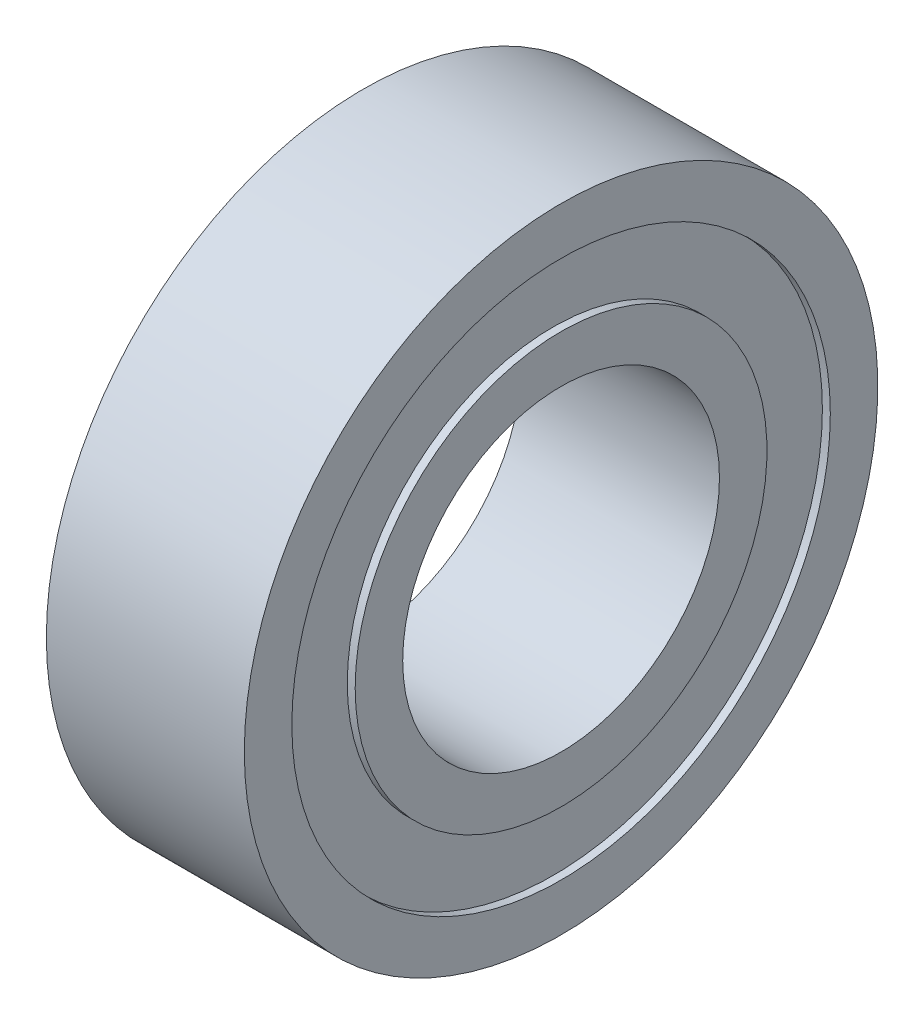
ISO-10303-21;
HEADER;
FILE_DESCRIPTION(('STEP AP214'),'2;1');
FILE_NAME('part.step','',(''),(''),'','','');
FILE_SCHEMA(('AUTOMOTIVE_DESIGN { 1 0 10303 214 1 1 1 1 }'));
ENDSEC;
DATA;
#1=APPLICATION_CONTEXT('core data for automotive mechanical design processes');
#2=APPLICATION_PROTOCOL_DEFINITION('international standard','automotive_design',2000,#1);
#3=PRODUCT_CONTEXT('',#1,'mechanical');
#4=PRODUCT('Part','Part','',(#3));
#5=PRODUCT_RELATED_PRODUCT_CATEGORY('part','',(#4));
#6=PRODUCT_DEFINITION_FORMATION('','',#4);
#7=PRODUCT_DEFINITION_CONTEXT('part definition',#1,'design');
#8=PRODUCT_DEFINITION('design','',#6,#7);
#9=PRODUCT_DEFINITION_SHAPE('','',#8);
#10=(LENGTH_UNIT() NAMED_UNIT(*) SI_UNIT(.MILLI.,.METRE.));
#11=(NAMED_UNIT(*) PLANE_ANGLE_UNIT() SI_UNIT($,.RADIAN.));
#12=(NAMED_UNIT(*) SI_UNIT($,.STERADIAN.) SOLID_ANGLE_UNIT());
#13=UNCERTAINTY_MEASURE_WITH_UNIT(LENGTH_MEASURE(1.E-05),#10,'distance_accuracy_value','');
#14=(GEOMETRIC_REPRESENTATION_CONTEXT(3) GLOBAL_UNCERTAINTY_ASSIGNED_CONTEXT((#13)) GLOBAL_UNIT_ASSIGNED_CONTEXT((#10,
#11,#12)) REPRESENTATION_CONTEXT('',''));
#15=CARTESIAN_POINT('',(0.,0.,0.));
#16=DIRECTION('',(0.,0.,1.));
#17=DIRECTION('',(1.,0.,0.));
#18=AXIS2_PLACEMENT_3D('',#15,#16,#17);
#19=CARTESIAN_POINT('',(-2.5,5.2,0.));
#20=DIRECTION('',(1.,0.,0.));
#21=DIRECTION('',(0.,0.,-1.));
#22=AXIS2_PLACEMENT_3D('',#19,#20,#21);
#23=PLANE('',#22);
#24=CARTESIAN_POINT('',(-2.5,0.,0.));
#25=DIRECTION('',(-1.,0.,0.));
#26=DIRECTION('',(0.,0.,1.));
#27=AXIS2_PLACEMENT_3D('',#24,#25,#26);
#28=CIRCLE('',#27,4.);
#29=CARTESIAN_POINT('',(-2.5,0.,4.));
#30=VERTEX_POINT('',#29);
#31=EDGE_CURVE('E10',#30,#30,#28,.T.);
#32=ORIENTED_EDGE('',*,*,#31,.F.);
#33=EDGE_LOOP('',(#32));
#34=FACE_BOUND('',#33,.T.);
#35=CARTESIAN_POINT('',(-2.5,0.,0.));
#36=DIRECTION('',(-1.,0.,0.));
#37=DIRECTION('',(0.,0.,1.));
#38=AXIS2_PLACEMENT_3D('',#35,#36,#37);
#39=CIRCLE('',#38,5.2);
#40=CARTESIAN_POINT('',(-2.5,0.,5.2));
#41=VERTEX_POINT('',#40);
#42=EDGE_CURVE('E54',#41,#41,#39,.T.);
#43=ORIENTED_EDGE('',*,*,#42,.T.);
#44=EDGE_LOOP('',(#43));
#45=FACE_BOUND('',#44,.T.);
#46=ADVANCED_FACE('F14',(#34,#45),#23,.F.);
#47=CARTESIAN_POINT('',(0.,0.,0.));
#48=DIRECTION('',(-1.,0.,0.));
#49=DIRECTION('',(0.,0.,1.));
#50=AXIS2_PLACEMENT_3D('',#47,#48,#49);
#51=CYLINDRICAL_SURFACE('',#50,4.);
#52=CARTESIAN_POINT('',(2.5,0.,0.));
#53=DIRECTION('',(-1.,0.,0.));
#54=DIRECTION('',(0.,0.,1.));
#55=AXIS2_PLACEMENT_3D('',#52,#53,#54);
#56=CIRCLE('',#55,4.);
#57=CARTESIAN_POINT('',(2.5,0.,4.));
#58=VERTEX_POINT('',#57);
#59=EDGE_CURVE('E20',#58,#58,#56,.T.);
#60=ORIENTED_EDGE('',*,*,#59,.F.);
#61=EDGE_LOOP('',(#60));
#62=FACE_BOUND('',#61,.T.);
#63=ORIENTED_EDGE('',*,*,#31,.T.);
#64=EDGE_LOOP('',(#63));
#65=FACE_BOUND('',#64,.T.);
#66=ADVANCED_FACE('F115',(#62,#65),#51,.F.);
#67=CARTESIAN_POINT('',(2.5,4.,0.));
#68=DIRECTION('',(-1.,0.,0.));
#69=DIRECTION('',(0.,0.,1.));
#70=AXIS2_PLACEMENT_3D('',#67,#68,#69);
#71=PLANE('',#70);
#72=CARTESIAN_POINT('',(2.5,0.,0.));
#73=DIRECTION('',(-1.,0.,0.));
#74=DIRECTION('',(0.,0.,1.));
#75=AXIS2_PLACEMENT_3D('',#72,#73,#74);
#76=CIRCLE('',#75,5.2);
#77=CARTESIAN_POINT('',(2.5,0.,5.2));
#78=VERTEX_POINT('',#77);
#79=EDGE_CURVE('E24',#78,#78,#76,.T.);
#80=ORIENTED_EDGE('',*,*,#79,.F.);
#81=EDGE_LOOP('',(#80));
#82=FACE_BOUND('',#81,.T.);
#83=ORIENTED_EDGE('',*,*,#59,.T.);
#84=EDGE_LOOP('',(#83));
#85=FACE_BOUND('',#84,.T.);
#86=ADVANCED_FACE('F110',(#82,#85),#71,.F.);
#87=CARTESIAN_POINT('',(0.,0.,0.));
#88=DIRECTION('',(-1.,0.,0.));
#89=DIRECTION('',(0.,0.,1.));
#90=AXIS2_PLACEMENT_3D('',#87,#88,#89);
#91=CYLINDRICAL_SURFACE('',#90,5.2);
#92=CARTESIAN_POINT('',(2.3,0.,0.));
#93=DIRECTION('',(-1.,0.,0.));
#94=DIRECTION('',(0.,0.,1.));
#95=AXIS2_PLACEMENT_3D('',#92,#93,#94);
#96=CIRCLE('',#95,5.2);
#97=CARTESIAN_POINT('',(2.3,0.,5.2));
#98=VERTEX_POINT('',#97);
#99=EDGE_CURVE('E28',#98,#98,#96,.T.);
#100=ORIENTED_EDGE('',*,*,#99,.F.);
#101=EDGE_LOOP('',(#100));
#102=FACE_BOUND('',#101,.T.);
#103=ORIENTED_EDGE('',*,*,#79,.T.);
#104=EDGE_LOOP('',(#103));
#105=FACE_BOUND('',#104,.T.);
#106=ADVANCED_FACE('F104',(#102,#105),#91,.T.);
#107=CARTESIAN_POINT('',(2.3,6.8,0.));
#108=DIRECTION('',(-1.,0.,0.));
#109=DIRECTION('',(0.,0.,1.));
#110=AXIS2_PLACEMENT_3D('',#107,#108,#109);
#111=PLANE('',#110);
#112=CARTESIAN_POINT('',(2.3,0.,0.));
#113=DIRECTION('',(-1.,0.,0.));
#114=DIRECTION('',(0.,0.,1.));
#115=AXIS2_PLACEMENT_3D('',#112,#113,#114);
#116=CIRCLE('',#115,6.8);
#117=CARTESIAN_POINT('',(2.3,0.,6.8));
#118=VERTEX_POINT('',#117);
#119=EDGE_CURVE('E33',#118,#118,#116,.T.);
#120=ORIENTED_EDGE('',*,*,#119,.F.);
#121=EDGE_LOOP('',(#120));
#122=FACE_BOUND('',#121,.T.);
#123=ORIENTED_EDGE('',*,*,#99,.T.);
#124=EDGE_LOOP('',(#123));
#125=FACE_BOUND('',#124,.T.);
#126=ADVANCED_FACE('F98',(#122,#125),#111,.F.);
#127=CARTESIAN_POINT('',(0.,0.,0.));
#128=DIRECTION('',(-1.,0.,0.));
#129=DIRECTION('',(0.,0.,1.));
#130=AXIS2_PLACEMENT_3D('',#127,#128,#129);
#131=CYLINDRICAL_SURFACE('',#130,6.8);
#132=CARTESIAN_POINT('',(2.5,0.,0.));
#133=DIRECTION('',(-1.,0.,0.));
#134=DIRECTION('',(0.,0.,1.));
#135=AXIS2_PLACEMENT_3D('',#132,#133,#134);
#136=CIRCLE('',#135,6.8);
#137=CARTESIAN_POINT('',(2.5,0.,6.8));
#138=VERTEX_POINT('',#137);
#139=EDGE_CURVE('E36',#138,#138,#136,.T.);
#140=ORIENTED_EDGE('',*,*,#139,.F.);
#141=EDGE_LOOP('',(#140));
#142=FACE_BOUND('',#141,.T.);
#143=ORIENTED_EDGE('',*,*,#119,.T.);
#144=EDGE_LOOP('',(#143));
#145=FACE_BOUND('',#144,.T.);
#146=ADVANCED_FACE('F92',(#142,#145),#131,.F.);
#147=CARTESIAN_POINT('',(2.5,6.8,0.));
#148=DIRECTION('',(-1.,0.,0.));
#149=DIRECTION('',(0.,0.,1.));
#150=AXIS2_PLACEMENT_3D('',#147,#148,#149);
#151=PLANE('',#150);
#152=CARTESIAN_POINT('',(2.5,0.,0.));
#153=DIRECTION('',(-1.,0.,0.));
#154=DIRECTION('',(0.,0.,1.));
#155=AXIS2_PLACEMENT_3D('',#152,#153,#154);
#156=CIRCLE('',#155,8.);
#157=CARTESIAN_POINT('',(2.5,0.,8.));
#158=VERTEX_POINT('',#157);
#159=EDGE_CURVE('E39',#158,#158,#156,.T.);
#160=ORIENTED_EDGE('',*,*,#159,.F.);
#161=EDGE_LOOP('',(#160));
#162=FACE_BOUND('',#161,.T.);
#163=ORIENTED_EDGE('',*,*,#139,.T.);
#164=EDGE_LOOP('',(#163));
#165=FACE_BOUND('',#164,.T.);
#166=ADVANCED_FACE('F86',(#162,#165),#151,.F.);
#167=CARTESIAN_POINT('',(0.,0.,0.));
#168=DIRECTION('',(-1.,0.,0.));
#169=DIRECTION('',(0.,0.,1.));
#170=AXIS2_PLACEMENT_3D('',#167,#168,#169);
#171=CYLINDRICAL_SURFACE('',#170,8.);
#172=CARTESIAN_POINT('',(-2.5,0.,0.));
#173=DIRECTION('',(-1.,0.,0.));
#174=DIRECTION('',(0.,0.,1.));
#175=AXIS2_PLACEMENT_3D('',#172,#173,#174);
#176=CIRCLE('',#175,8.);
#177=CARTESIAN_POINT('',(-2.5,0.,8.));
#178=VERTEX_POINT('',#177);
#179=EDGE_CURVE('E42',#178,#178,#176,.T.);
#180=ORIENTED_EDGE('',*,*,#179,.F.);
#181=EDGE_LOOP('',(#180));
#182=FACE_BOUND('',#181,.T.);
#183=ORIENTED_EDGE('',*,*,#159,.T.);
#184=EDGE_LOOP('',(#183));
#185=FACE_BOUND('',#184,.T.);
#186=ADVANCED_FACE('F80',(#182,#185),#171,.T.);
#187=CARTESIAN_POINT('',(-2.5,8.,0.));
#188=DIRECTION('',(1.,0.,0.));
#189=DIRECTION('',(0.,0.,-1.));
#190=AXIS2_PLACEMENT_3D('',#187,#188,#189);
#191=PLANE('',#190);
#192=CARTESIAN_POINT('',(-2.5,0.,0.));
#193=DIRECTION('',(-1.,0.,0.));
#194=DIRECTION('',(0.,0.,1.));
#195=AXIS2_PLACEMENT_3D('',#192,#193,#194);
#196=CIRCLE('',#195,6.8);
#197=CARTESIAN_POINT('',(-2.5,0.,6.8));
#198=VERTEX_POINT('',#197);
#199=EDGE_CURVE('E45',#198,#198,#196,.T.);
#200=ORIENTED_EDGE('',*,*,#199,.F.);
#201=EDGE_LOOP('',(#200));
#202=FACE_BOUND('',#201,.T.);
#203=ORIENTED_EDGE('',*,*,#179,.T.);
#204=EDGE_LOOP('',(#203));
#205=FACE_BOUND('',#204,.T.);
#206=ADVANCED_FACE('F74',(#202,#205),#191,.F.);
#207=CARTESIAN_POINT('',(0.,0.,0.));
#208=DIRECTION('',(-1.,0.,0.));
#209=DIRECTION('',(0.,0.,1.));
#210=AXIS2_PLACEMENT_3D('',#207,#208,#209);
#211=CYLINDRICAL_SURFACE('',#210,6.8);
#212=CARTESIAN_POINT('',(-2.3,0.,0.));
#213=DIRECTION('',(-1.,0.,0.));
#214=DIRECTION('',(0.,0.,1.));
#215=AXIS2_PLACEMENT_3D('',#212,#213,#214);
#216=CIRCLE('',#215,6.8);
#217=CARTESIAN_POINT('',(-2.3,0.,6.8));
#218=VERTEX_POINT('',#217);
#219=EDGE_CURVE('E48',#218,#218,#216,.T.);
#220=ORIENTED_EDGE('',*,*,#219,.F.);
#221=EDGE_LOOP('',(#220));
#222=FACE_BOUND('',#221,.T.);
#223=ORIENTED_EDGE('',*,*,#199,.T.);
#224=EDGE_LOOP('',(#223));
#225=FACE_BOUND('',#224,.T.);
#226=ADVANCED_FACE('F68',(#222,#225),#211,.F.);
#227=CARTESIAN_POINT('',(-2.3,5.2,0.));
#228=DIRECTION('',(1.,0.,0.));
#229=DIRECTION('',(0.,0.,-1.));
#230=AXIS2_PLACEMENT_3D('',#227,#228,#229);
#231=PLANE('',#230);
#232=CARTESIAN_POINT('',(-2.3,0.,0.));
#233=DIRECTION('',(-1.,0.,0.));
#234=DIRECTION('',(0.,0.,1.));
#235=AXIS2_PLACEMENT_3D('',#232,#233,#234);
#236=CIRCLE('',#235,5.2);
#237=CARTESIAN_POINT('',(-2.3,0.,5.2));
#238=VERTEX_POINT('',#237);
#239=EDGE_CURVE('E51',#238,#238,#236,.T.);
#240=ORIENTED_EDGE('',*,*,#239,.F.);
#241=EDGE_LOOP('',(#240));
#242=FACE_BOUND('',#241,.T.);
#243=ORIENTED_EDGE('',*,*,#219,.T.);
#244=EDGE_LOOP('',(#243));
#245=FACE_BOUND('',#244,.T.);
#246=ADVANCED_FACE('F62',(#242,#245),#231,.F.);
#247=CARTESIAN_POINT('',(0.,0.,0.));
#248=DIRECTION('',(-1.,0.,0.));
#249=DIRECTION('',(0.,0.,1.));
#250=AXIS2_PLACEMENT_3D('',#247,#248,#249);
#251=CYLINDRICAL_SURFACE('',#250,5.2);
#252=ORIENTED_EDGE('',*,*,#42,.F.);
#253=EDGE_LOOP('',(#252));
#254=FACE_BOUND('',#253,.T.);
#255=ORIENTED_EDGE('',*,*,#239,.T.);
#256=EDGE_LOOP('',(#255));
#257=FACE_BOUND('',#256,.T.);
#258=ADVANCED_FACE('F59',(#254,#257),#251,.T.);
#259=CLOSED_SHELL('',(#46,#66,#86,#106,#126,#146,#166,#186,#206,#226,#246,#258));
#260=MANIFOLD_SOLID_BREP('B1',#259);
#261=ADVANCED_BREP_SHAPE_REPRESENTATION('',(#18,#260),#14);
#262=SHAPE_DEFINITION_REPRESENTATION(#9,#261);
ENDSEC;
END-ISO-10303-21;
